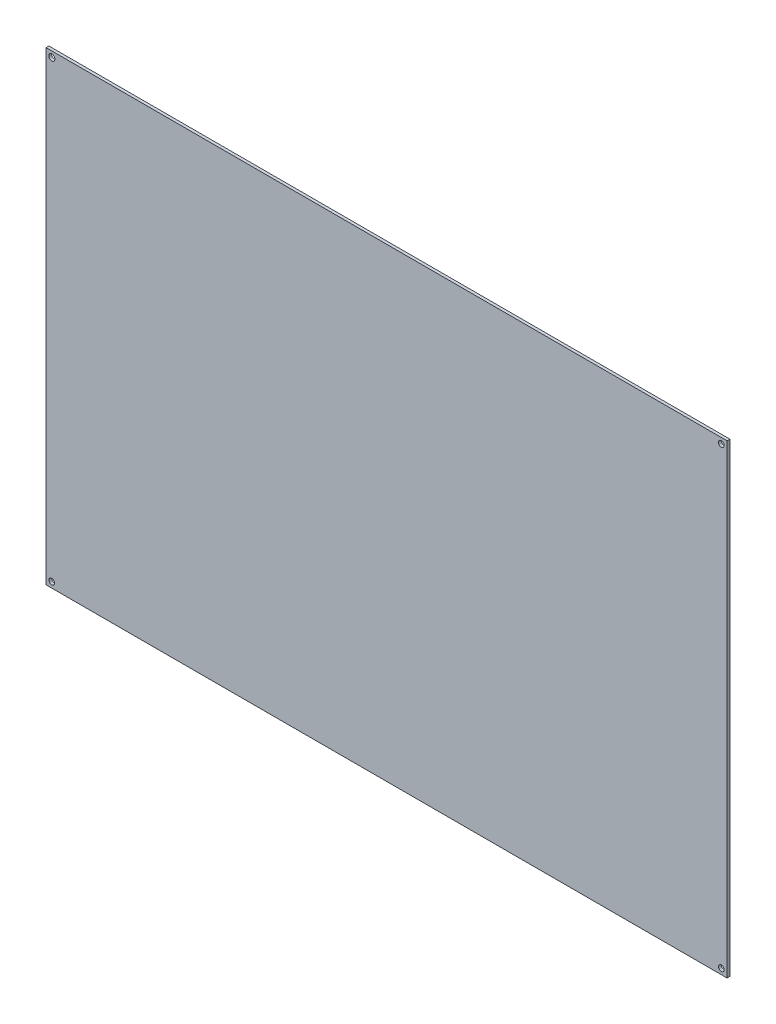
ISO-10303-21;
HEADER;
FILE_DESCRIPTION(('STEP AP214'),'2;1');
FILE_NAME('part.step','',(''),(''),'','','');
FILE_SCHEMA(('AUTOMOTIVE_DESIGN { 1 0 10303 214 1 1 1 1 }'));
ENDSEC;
DATA;
#1=APPLICATION_CONTEXT('core data for automotive mechanical design processes');
#2=APPLICATION_PROTOCOL_DEFINITION('international standard','automotive_design',2000,#1);
#3=PRODUCT_CONTEXT('',#1,'mechanical');
#4=PRODUCT('Part','Part','',(#3));
#5=PRODUCT_RELATED_PRODUCT_CATEGORY('part','',(#4));
#6=PRODUCT_DEFINITION_FORMATION('','',#4);
#7=PRODUCT_DEFINITION_CONTEXT('part definition',#1,'design');
#8=PRODUCT_DEFINITION('design','',#6,#7);
#9=PRODUCT_DEFINITION_SHAPE('','',#8);
#10=(LENGTH_UNIT() NAMED_UNIT(*) SI_UNIT(.MILLI.,.METRE.));
#11=(NAMED_UNIT(*) PLANE_ANGLE_UNIT() SI_UNIT($,.RADIAN.));
#12=(NAMED_UNIT(*) SI_UNIT($,.STERADIAN.) SOLID_ANGLE_UNIT());
#13=UNCERTAINTY_MEASURE_WITH_UNIT(LENGTH_MEASURE(1.E-05),#10,'distance_accuracy_value','');
#14=(GEOMETRIC_REPRESENTATION_CONTEXT(3) GLOBAL_UNCERTAINTY_ASSIGNED_CONTEXT((#13)) GLOBAL_UNIT_ASSIGNED_CONTEXT((#10,
#11,#12)) REPRESENTATION_CONTEXT('',''));
#15=CARTESIAN_POINT('',(0.,0.,0.));
#16=DIRECTION('',(0.,0.,1.));
#17=DIRECTION('',(1.,0.,0.));
#18=AXIS2_PLACEMENT_3D('',#15,#16,#17);
#19=CARTESIAN_POINT('',(-381.,-260.35,3.175));
#20=DIRECTION('',(1.,0.,0.));
#21=DIRECTION('',(0.,0.,-1.));
#22=AXIS2_PLACEMENT_3D('',#19,#20,#21);
#23=PLANE('',#22);
#24=DIRECTION('',(0.,-1.,0.));
#25=VECTOR('',#24,1.);
#26=CARTESIAN_POINT('',(-381.,-260.35,0.));
#27=LINE('',#26,#25);
#28=CARTESIAN_POINT('',(-381.,260.35,0.));
#29=VERTEX_POINT('',#28);
#30=CARTESIAN_POINT('',(-381.,-260.35,0.));
#31=VERTEX_POINT('',#30);
#32=EDGE_CURVE('E110',#29,#31,#27,.T.);
#33=ORIENTED_EDGE('',*,*,#32,.T.);
#34=DIRECTION('',(0.,0.,-1.));
#35=VECTOR('',#34,1.);
#36=CARTESIAN_POINT('',(-381.,-260.35,3.175));
#37=LINE('',#36,#35);
#38=CARTESIAN_POINT('',(-381.,-260.35,3.175));
#39=VERTEX_POINT('',#38);
#40=EDGE_CURVE('E11',#39,#31,#37,.T.);
#41=ORIENTED_EDGE('',*,*,#40,.F.);
#42=DIRECTION('',(0.,-1.,0.));
#43=VECTOR('',#42,1.);
#44=CARTESIAN_POINT('',(-381.,-260.35,3.175));
#45=LINE('',#44,#43);
#46=CARTESIAN_POINT('',(-381.,260.35,3.175));
#47=VERTEX_POINT('',#46);
#48=EDGE_CURVE('E93',#47,#39,#45,.T.);
#49=ORIENTED_EDGE('',*,*,#48,.F.);
#50=DIRECTION('',(0.,0.,-1.));
#51=VECTOR('',#50,1.);
#52=CARTESIAN_POINT('',(-381.,260.35,3.175));
#53=LINE('',#52,#51);
#54=EDGE_CURVE('E106',#47,#29,#53,.T.);
#55=ORIENTED_EDGE('',*,*,#54,.T.);
#56=EDGE_LOOP('',(#33,#41,#49,#55));
#57=FACE_BOUND('',#56,.T.);
#58=ADVANCED_FACE('F39',(#57),#23,.F.);
#59=CARTESIAN_POINT('',(381.,-260.35,3.175));
#60=DIRECTION('',(0.,1.,0.));
#61=DIRECTION('',(-1.,0.,0.));
#62=AXIS2_PLACEMENT_3D('',#59,#60,#61);
#63=PLANE('',#62);
#64=DIRECTION('',(1.,0.,0.));
#65=VECTOR('',#64,1.);
#66=CARTESIAN_POINT('',(381.,-260.35,0.));
#67=LINE('',#66,#65);
#68=CARTESIAN_POINT('',(381.,-260.35,0.));
#69=VERTEX_POINT('',#68);
#70=EDGE_CURVE('E98',#31,#69,#67,.T.);
#71=ORIENTED_EDGE('',*,*,#70,.T.);
#72=DIRECTION('',(0.,0.,-1.));
#73=VECTOR('',#72,1.);
#74=CARTESIAN_POINT('',(381.,-260.35,3.175));
#75=LINE('',#74,#73);
#76=CARTESIAN_POINT('',(381.,-260.35,3.175));
#77=VERTEX_POINT('',#76);
#78=EDGE_CURVE('E49',#77,#69,#75,.T.);
#79=ORIENTED_EDGE('',*,*,#78,.F.);
#80=DIRECTION('',(1.,0.,0.));
#81=VECTOR('',#80,1.);
#82=CARTESIAN_POINT('',(381.,-260.35,3.175));
#83=LINE('',#82,#81);
#84=EDGE_CURVE('E88',#39,#77,#83,.T.);
#85=ORIENTED_EDGE('',*,*,#84,.F.);
#86=ORIENTED_EDGE('',*,*,#40,.T.);
#87=EDGE_LOOP('',(#71,#79,#85,#86));
#88=FACE_BOUND('',#87,.T.);
#89=ADVANCED_FACE('F97',(#88),#63,.F.);
#90=CARTESIAN_POINT('',(381.,-260.35,3.175));
#91=DIRECTION('',(-1.,0.,0.));
#92=DIRECTION('',(0.,0.,1.));
#93=AXIS2_PLACEMENT_3D('',#90,#91,#92);
#94=PLANE('',#93);
#95=DIRECTION('',(0.,1.,0.));
#96=VECTOR('',#95,1.);
#97=CARTESIAN_POINT('',(381.,-260.35,0.));
#98=LINE('',#97,#96);
#99=CARTESIAN_POINT('',(381.,260.35,0.));
#100=VERTEX_POINT('',#99);
#101=EDGE_CURVE('E75',#69,#100,#98,.T.);
#102=ORIENTED_EDGE('',*,*,#101,.T.);
#103=DIRECTION('',(0.,0.,-1.));
#104=VECTOR('',#103,1.);
#105=CARTESIAN_POINT('',(381.,260.35,3.175));
#106=LINE('',#105,#104);
#107=CARTESIAN_POINT('',(381.,260.35,3.175));
#108=VERTEX_POINT('',#107);
#109=EDGE_CURVE('E100',#108,#100,#106,.T.);
#110=ORIENTED_EDGE('',*,*,#109,.F.);
#111=DIRECTION('',(0.,1.,0.));
#112=VECTOR('',#111,1.);
#113=CARTESIAN_POINT('',(381.,-260.35,3.175));
#114=LINE('',#113,#112);
#115=EDGE_CURVE('E91',#77,#108,#114,.T.);
#116=ORIENTED_EDGE('',*,*,#115,.F.);
#117=ORIENTED_EDGE('',*,*,#78,.T.);
#118=EDGE_LOOP('',(#102,#110,#116,#117));
#119=FACE_BOUND('',#118,.T.);
#120=ADVANCED_FACE('F102',(#119),#94,.F.);
#121=CARTESIAN_POINT('',(381.,260.35,3.175));
#122=DIRECTION('',(0.,-1.,0.));
#123=DIRECTION('',(1.,0.,0.));
#124=AXIS2_PLACEMENT_3D('',#121,#122,#123);
#125=PLANE('',#124);
#126=DIRECTION('',(-1.,0.,0.));
#127=VECTOR('',#126,1.);
#128=CARTESIAN_POINT('',(381.,260.35,0.));
#129=LINE('',#128,#127);
#130=EDGE_CURVE('E81',#100,#29,#129,.T.);
#131=ORIENTED_EDGE('',*,*,#130,.T.);
#132=ORIENTED_EDGE('',*,*,#54,.F.);
#133=DIRECTION('',(-1.,0.,0.));
#134=VECTOR('',#133,1.);
#135=CARTESIAN_POINT('',(381.,260.35,3.175));
#136=LINE('',#135,#134);
#137=EDGE_CURVE('E58',#108,#47,#136,.T.);
#138=ORIENTED_EDGE('',*,*,#137,.F.);
#139=ORIENTED_EDGE('',*,*,#109,.T.);
#140=EDGE_LOOP('',(#131,#132,#138,#139));
#141=FACE_BOUND('',#140,.T.);
#142=ADVANCED_FACE('F172',(#141),#125,.F.);
#143=CARTESIAN_POINT('',(0.,0.,3.175));
#144=DIRECTION('',(0.,0.,1.));
#145=DIRECTION('',(1.,0.,0.));
#146=AXIS2_PLACEMENT_3D('',#143,#144,#145);
#147=PLANE('',#146);
#148=CARTESIAN_POINT('',(374.65,254.,3.175));
#149=DIRECTION('',(0.,0.,1.));
#150=DIRECTION('',(1.,0.,0.));
#151=AXIS2_PLACEMENT_3D('',#148,#149,#150);
#152=CIRCLE('',#151,3.17499999999997);
#153=CARTESIAN_POINT('',(377.825,254.,3.175));
#154=VERTEX_POINT('',#153);
#155=EDGE_CURVE('E238',#154,#154,#152,.T.);
#156=ORIENTED_EDGE('',*,*,#155,.F.);
#157=EDGE_LOOP('',(#156));
#158=FACE_BOUND('',#157,.T.);
#159=CARTESIAN_POINT('',(-374.65,-254.,3.175));
#160=DIRECTION('',(0.,0.,1.));
#161=DIRECTION('',(1.,0.,0.));
#162=AXIS2_PLACEMENT_3D('',#159,#160,#161);
#163=CIRCLE('',#162,3.17499999999997);
#164=CARTESIAN_POINT('',(-371.475,-254.,3.175));
#165=VERTEX_POINT('',#164);
#166=EDGE_CURVE('E234',#165,#165,#163,.T.);
#167=ORIENTED_EDGE('',*,*,#166,.F.);
#168=EDGE_LOOP('',(#167));
#169=FACE_BOUND('',#168,.T.);
#170=CARTESIAN_POINT('',(374.65,-254.,3.175));
#171=DIRECTION('',(0.,0.,1.));
#172=DIRECTION('',(1.,0.,0.));
#173=AXIS2_PLACEMENT_3D('',#170,#171,#172);
#174=CIRCLE('',#173,3.17499999999997);
#175=CARTESIAN_POINT('',(377.825,-254.,3.175));
#176=VERTEX_POINT('',#175);
#177=EDGE_CURVE('E226',#176,#176,#174,.T.);
#178=ORIENTED_EDGE('',*,*,#177,.F.);
#179=EDGE_LOOP('',(#178));
#180=FACE_BOUND('',#179,.T.);
#181=CARTESIAN_POINT('',(-374.65,254.,3.175));
#182=DIRECTION('',(0.,0.,1.));
#183=DIRECTION('',(1.,0.,0.));
#184=AXIS2_PLACEMENT_3D('',#181,#182,#183);
#185=CIRCLE('',#184,3.429);
#186=CARTESIAN_POINT('',(-371.221,254.,3.175));
#187=VERTEX_POINT('',#186);
#188=EDGE_CURVE('E129',#187,#187,#185,.T.);
#189=ORIENTED_EDGE('',*,*,#188,.F.);
#190=EDGE_LOOP('',(#189));
#191=FACE_BOUND('',#190,.T.);
#192=ORIENTED_EDGE('',*,*,#48,.T.);
#193=ORIENTED_EDGE('',*,*,#84,.T.);
#194=ORIENTED_EDGE('',*,*,#115,.T.);
#195=ORIENTED_EDGE('',*,*,#137,.T.);
#196=EDGE_LOOP('',(#192,#193,#194,#195));
#197=FACE_BOUND('',#196,.T.);
#198=ADVANCED_FACE('F89',(#158,#169,#180,#191,#197),#147,.T.);
#199=CARTESIAN_POINT('',(0.,0.,0.));
#200=DIRECTION('',(0.,0.,1.));
#201=DIRECTION('',(1.,0.,0.));
#202=AXIS2_PLACEMENT_3D('',#199,#200,#201);
#203=PLANE('',#202);
#204=CARTESIAN_POINT('',(374.65,254.,0.));
#205=DIRECTION('',(0.,0.,1.));
#206=DIRECTION('',(1.,0.,0.));
#207=AXIS2_PLACEMENT_3D('',#204,#205,#206);
#208=CIRCLE('',#207,3.17499999999997);
#209=CARTESIAN_POINT('',(377.825,254.,0.));
#210=VERTEX_POINT('',#209);
#211=EDGE_CURVE('E42',#210,#210,#208,.T.);
#212=ORIENTED_EDGE('',*,*,#211,.T.);
#213=EDGE_LOOP('',(#212));
#214=FACE_BOUND('',#213,.T.);
#215=CARTESIAN_POINT('',(-374.65,-254.,0.));
#216=DIRECTION('',(0.,0.,1.));
#217=DIRECTION('',(1.,0.,0.));
#218=AXIS2_PLACEMENT_3D('',#215,#216,#217);
#219=CIRCLE('',#218,3.17499999999997);
#220=CARTESIAN_POINT('',(-371.475,-254.,0.));
#221=VERTEX_POINT('',#220);
#222=EDGE_CURVE('E132',#221,#221,#219,.T.);
#223=ORIENTED_EDGE('',*,*,#222,.T.);
#224=EDGE_LOOP('',(#223));
#225=FACE_BOUND('',#224,.T.);
#226=CARTESIAN_POINT('',(374.65,-254.,0.));
#227=DIRECTION('',(0.,0.,1.));
#228=DIRECTION('',(1.,0.,0.));
#229=AXIS2_PLACEMENT_3D('',#226,#227,#228);
#230=CIRCLE('',#229,3.17499999999997);
#231=CARTESIAN_POINT('',(377.825,-254.,0.));
#232=VERTEX_POINT('',#231);
#233=EDGE_CURVE('E128',#232,#232,#230,.T.);
#234=ORIENTED_EDGE('',*,*,#233,.T.);
#235=EDGE_LOOP('',(#234));
#236=FACE_BOUND('',#235,.T.);
#237=CARTESIAN_POINT('',(-374.65,254.,0.));
#238=DIRECTION('',(0.,0.,1.));
#239=DIRECTION('',(1.,0.,0.));
#240=AXIS2_PLACEMENT_3D('',#237,#238,#239);
#241=CIRCLE('',#240,3.429);
#242=CARTESIAN_POINT('',(-371.221,254.,0.));
#243=VERTEX_POINT('',#242);
#244=EDGE_CURVE('E124',#243,#243,#241,.T.);
#245=ORIENTED_EDGE('',*,*,#244,.T.);
#246=EDGE_LOOP('',(#245));
#247=FACE_BOUND('',#246,.T.);
#248=ORIENTED_EDGE('',*,*,#32,.F.);
#249=ORIENTED_EDGE('',*,*,#130,.F.);
#250=ORIENTED_EDGE('',*,*,#101,.F.);
#251=ORIENTED_EDGE('',*,*,#70,.F.);
#252=EDGE_LOOP('',(#248,#249,#250,#251));
#253=FACE_BOUND('',#252,.T.);
#254=ADVANCED_FACE('F141',(#214,#225,#236,#247,#253),#203,.F.);
#255=CARTESIAN_POINT('',(-374.65,254.,-3.175));
#256=DIRECTION('',(0.,0.,1.));
#257=DIRECTION('',(1.,0.,0.));
#258=AXIS2_PLACEMENT_3D('',#255,#256,#257);
#259=CYLINDRICAL_SURFACE('',#258,3.429);
#260=ORIENTED_EDGE('',*,*,#188,.T.);
#261=EDGE_LOOP('',(#260));
#262=FACE_BOUND('',#261,.T.);
#263=ORIENTED_EDGE('',*,*,#244,.F.);
#264=EDGE_LOOP('',(#263));
#265=FACE_BOUND('',#264,.T.);
#266=ADVANCED_FACE('F164',(#262,#265),#259,.F.);
#267=CARTESIAN_POINT('',(374.65,-254.,-3.175));
#268=DIRECTION('',(0.,0.,1.));
#269=DIRECTION('',(1.,0.,0.));
#270=AXIS2_PLACEMENT_3D('',#267,#268,#269);
#271=CYLINDRICAL_SURFACE('',#270,3.17499999999997);
#272=ORIENTED_EDGE('',*,*,#177,.T.);
#273=EDGE_LOOP('',(#272));
#274=FACE_BOUND('',#273,.T.);
#275=ORIENTED_EDGE('',*,*,#233,.F.);
#276=EDGE_LOOP('',(#275));
#277=FACE_BOUND('',#276,.T.);
#278=ADVANCED_FACE('F151',(#274,#277),#271,.F.);
#279=CARTESIAN_POINT('',(-374.65,-254.,-3.175));
#280=DIRECTION('',(0.,0.,1.));
#281=DIRECTION('',(1.,0.,0.));
#282=AXIS2_PLACEMENT_3D('',#279,#280,#281);
#283=CYLINDRICAL_SURFACE('',#282,3.17499999999997);
#284=ORIENTED_EDGE('',*,*,#166,.T.);
#285=EDGE_LOOP('',(#284));
#286=FACE_BOUND('',#285,.T.);
#287=ORIENTED_EDGE('',*,*,#222,.F.);
#288=EDGE_LOOP('',(#287));
#289=FACE_BOUND('',#288,.T.);
#290=ADVANCED_FACE('F145',(#286,#289),#283,.F.);
#291=CARTESIAN_POINT('',(374.65,254.,-3.175));
#292=DIRECTION('',(0.,0.,1.));
#293=DIRECTION('',(1.,0.,0.));
#294=AXIS2_PLACEMENT_3D('',#291,#292,#293);
#295=CYLINDRICAL_SURFACE('',#294,3.17499999999997);
#296=ORIENTED_EDGE('',*,*,#155,.T.);
#297=EDGE_LOOP('',(#296));
#298=FACE_BOUND('',#297,.T.);
#299=ORIENTED_EDGE('',*,*,#211,.F.);
#300=EDGE_LOOP('',(#299));
#301=FACE_BOUND('',#300,.T.);
#302=ADVANCED_FACE('F143',(#298,#301),#295,.F.);
#303=CLOSED_SHELL('',(#58,#89,#120,#142,#198,#254,#266,#278,#290,#302));
#304=MANIFOLD_SOLID_BREP('B2',#303);
#305=ADVANCED_BREP_SHAPE_REPRESENTATION('',(#18,#304),#14);
#306=SHAPE_DEFINITION_REPRESENTATION(#9,#305);
ENDSEC;
END-ISO-10303-21;
